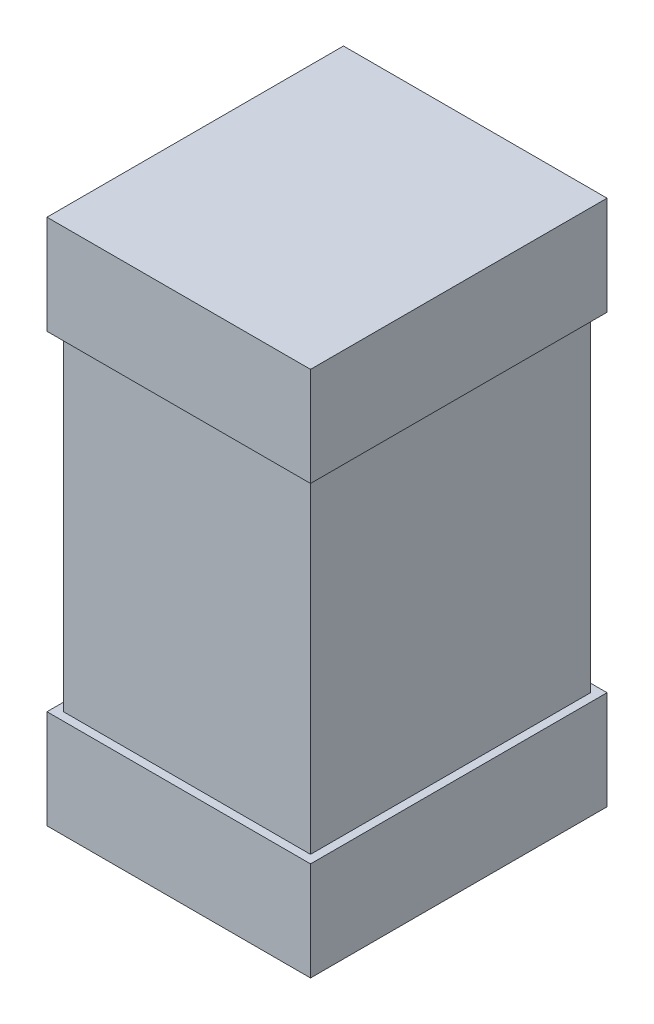
ISO-10303-21;
HEADER;
FILE_DESCRIPTION(('STEP AP214'),'2;1');
FILE_NAME('part.step','',(''),(''),'','','');
FILE_SCHEMA(('AUTOMOTIVE_DESIGN { 1 0 10303 214 1 1 1 1 }'));
ENDSEC;
DATA;
#1=APPLICATION_CONTEXT('core data for automotive mechanical design processes');
#2=APPLICATION_PROTOCOL_DEFINITION('international standard','automotive_design',2000,#1);
#3=PRODUCT_CONTEXT('',#1,'mechanical');
#4=PRODUCT('Part','Part','',(#3));
#5=PRODUCT_RELATED_PRODUCT_CATEGORY('part','',(#4));
#6=PRODUCT_DEFINITION_FORMATION('','',#4);
#7=PRODUCT_DEFINITION_CONTEXT('part definition',#1,'design');
#8=PRODUCT_DEFINITION('design','',#6,#7);
#9=PRODUCT_DEFINITION_SHAPE('','',#8);
#10=(LENGTH_UNIT() NAMED_UNIT(*) SI_UNIT(.MILLI.,.METRE.));
#11=(NAMED_UNIT(*) PLANE_ANGLE_UNIT() SI_UNIT($,.RADIAN.));
#12=(NAMED_UNIT(*) SI_UNIT($,.STERADIAN.) SOLID_ANGLE_UNIT());
#13=UNCERTAINTY_MEASURE_WITH_UNIT(LENGTH_MEASURE(1.E-05),#10,'distance_accuracy_value','');
#14=(GEOMETRIC_REPRESENTATION_CONTEXT(3) GLOBAL_UNCERTAINTY_ASSIGNED_CONTEXT((#13)) GLOBAL_UNIT_ASSIGNED_CONTEXT((#10,
#11,#12)) REPRESENTATION_CONTEXT('',''));
#15=CARTESIAN_POINT('',(0.,0.,0.));
#16=DIRECTION('',(0.,0.,1.));
#17=DIRECTION('',(1.,0.,0.));
#18=AXIS2_PLACEMENT_3D('',#15,#16,#17);
#19=CARTESIAN_POINT('',(-0.375,-0.8,-0.425));
#20=DIRECTION('',(0.,-1.,0.));
#21=DIRECTION('',(0.,0.,-1.));
#22=AXIS2_PLACEMENT_3D('',#19,#20,#21);
#23=PLANE('',#22);
#24=DIRECTION('',(0.,0.,-1.));
#25=VECTOR('',#24,1.);
#26=CARTESIAN_POINT('',(0.4,-0.8,-0.45));
#27=LINE('',#26,#25);
#28=CARTESIAN_POINT('',(0.4,-0.8,0.45));
#29=VERTEX_POINT('',#28);
#30=CARTESIAN_POINT('',(0.4,-0.8,-0.45));
#31=VERTEX_POINT('',#30);
#32=EDGE_CURVE('E108',#29,#31,#27,.T.);
#33=ORIENTED_EDGE('',*,*,#32,.F.);
#34=DIRECTION('',(1.,0.,0.));
#35=VECTOR('',#34,1.);
#36=CARTESIAN_POINT('',(0.4,-0.8,0.45));
#37=LINE('',#36,#35);
#38=CARTESIAN_POINT('',(-0.4,-0.8,0.45));
#39=VERTEX_POINT('',#38);
#40=EDGE_CURVE('E103',#39,#29,#37,.T.);
#41=ORIENTED_EDGE('',*,*,#40,.F.);
#42=DIRECTION('',(0.,0.,1.));
#43=VECTOR('',#42,1.);
#44=CARTESIAN_POINT('',(-0.4,-0.8,0.45));
#45=LINE('',#44,#43);
#46=CARTESIAN_POINT('',(-0.4,-0.8,-0.45));
#47=VERTEX_POINT('',#46);
#48=EDGE_CURVE('E118',#47,#39,#45,.T.);
#49=ORIENTED_EDGE('',*,*,#48,.F.);
#50=DIRECTION('',(-1.,0.,0.));
#51=VECTOR('',#50,1.);
#52=CARTESIAN_POINT('',(-0.4,-0.8,-0.45));
#53=LINE('',#52,#51);
#54=EDGE_CURVE('E20',#31,#47,#53,.T.);
#55=ORIENTED_EDGE('',*,*,#54,.F.);
#56=EDGE_LOOP('',(#33,#41,#49,#55));
#57=FACE_BOUND('',#56,.T.);
#58=ADVANCED_FACE('F17',(#57),#23,.T.);
#59=CARTESIAN_POINT('',(-0.375,0.8,-0.425));
#60=DIRECTION('',(0.,-1.,0.));
#61=DIRECTION('',(0.,0.,-1.));
#62=AXIS2_PLACEMENT_3D('',#59,#60,#61);
#63=PLANE('',#62);
#64=DIRECTION('',(0.,0.,1.));
#65=VECTOR('',#64,1.);
#66=CARTESIAN_POINT('',(-0.4,0.8,-0.45));
#67=LINE('',#66,#65);
#68=CARTESIAN_POINT('',(-0.4,0.8,0.45));
#69=VERTEX_POINT('',#68);
#70=CARTESIAN_POINT('',(-0.4,0.8,-0.45));
#71=VERTEX_POINT('',#70);
#72=EDGE_CURVE('E134',#69,#71,#67,.F.);
#73=ORIENTED_EDGE('',*,*,#72,.F.);
#74=DIRECTION('',(1.,0.,0.));
#75=VECTOR('',#74,1.);
#76=CARTESIAN_POINT('',(-0.4,0.8,0.45));
#77=LINE('',#76,#75);
#78=CARTESIAN_POINT('',(0.4,0.8,0.45));
#79=VERTEX_POINT('',#78);
#80=EDGE_CURVE('E136',#79,#69,#77,.F.);
#81=ORIENTED_EDGE('',*,*,#80,.F.);
#82=DIRECTION('',(0.,0.,-1.));
#83=VECTOR('',#82,1.);
#84=CARTESIAN_POINT('',(0.4,0.8,0.45));
#85=LINE('',#84,#83);
#86=CARTESIAN_POINT('',(0.4,0.8,-0.45));
#87=VERTEX_POINT('',#86);
#88=EDGE_CURVE('E140',#87,#79,#85,.F.);
#89=ORIENTED_EDGE('',*,*,#88,.F.);
#90=DIRECTION('',(-1.,0.,0.));
#91=VECTOR('',#90,1.);
#92=CARTESIAN_POINT('',(0.4,0.8,-0.45));
#93=LINE('',#92,#91);
#94=EDGE_CURVE('E144',#71,#87,#93,.F.);
#95=ORIENTED_EDGE('',*,*,#94,.F.);
#96=EDGE_LOOP('',(#73,#81,#89,#95));
#97=FACE_BOUND('',#96,.T.);
#98=ADVANCED_FACE('F236',(#97),#63,.F.);
#99=CARTESIAN_POINT('',(-0.4,-0.5,-0.45));
#100=DIRECTION('',(0.,0.,-1.));
#101=DIRECTION('',(-1.,0.,0.));
#102=AXIS2_PLACEMENT_3D('',#99,#100,#101);
#103=PLANE('',#102);
#104=DIRECTION('',(1.,0.,0.));
#105=VECTOR('',#104,1.);
#106=CARTESIAN_POINT('',(-0.4,-0.5,-0.45));
#107=LINE('',#106,#105);
#108=CARTESIAN_POINT('',(-0.4,-0.5,-0.45));
#109=VERTEX_POINT('',#108);
#110=CARTESIAN_POINT('',(0.4,-0.5,-0.45));
#111=VERTEX_POINT('',#110);
#112=EDGE_CURVE('E124',#109,#111,#107,.T.);
#113=ORIENTED_EDGE('',*,*,#112,.T.);
#114=DIRECTION('',(0.,1.,0.));
#115=VECTOR('',#114,1.);
#116=CARTESIAN_POINT('',(0.4,-0.5,-0.45));
#117=LINE('',#116,#115);
#118=EDGE_CURVE('E113',#31,#111,#117,.T.);
#119=ORIENTED_EDGE('',*,*,#118,.F.);
#120=ORIENTED_EDGE('',*,*,#54,.T.);
#121=DIRECTION('',(0.,1.,0.));
#122=VECTOR('',#121,1.);
#123=CARTESIAN_POINT('',(-0.4,-0.5,-0.45));
#124=LINE('',#123,#122);
#125=EDGE_CURVE('E132',#109,#47,#124,.F.);
#126=ORIENTED_EDGE('',*,*,#125,.F.);
#127=EDGE_LOOP('',(#113,#119,#120,#126));
#128=FACE_BOUND('',#127,.T.);
#129=ADVANCED_FACE('F123',(#128),#103,.T.);
#130=CARTESIAN_POINT('',(0.4,-0.5,-0.45));
#131=DIRECTION('',(1.,0.,0.));
#132=DIRECTION('',(0.,0.,-1.));
#133=AXIS2_PLACEMENT_3D('',#130,#131,#132);
#134=PLANE('',#133);
#135=DIRECTION('',(0.,0.,-1.));
#136=VECTOR('',#135,1.);
#137=CARTESIAN_POINT('',(0.4,-0.5,-0.45));
#138=LINE('',#137,#136);
#139=CARTESIAN_POINT('',(0.4,-0.5,0.45));
#140=VERTEX_POINT('',#139);
#141=EDGE_CURVE('E154',#111,#140,#138,.F.);
#142=ORIENTED_EDGE('',*,*,#141,.T.);
#143=DIRECTION('',(0.,1.,0.));
#144=VECTOR('',#143,1.);
#145=CARTESIAN_POINT('',(0.4,-0.5,0.45));
#146=LINE('',#145,#144);
#147=EDGE_CURVE('E115',#29,#140,#146,.T.);
#148=ORIENTED_EDGE('',*,*,#147,.F.);
#149=ORIENTED_EDGE('',*,*,#32,.T.);
#150=ORIENTED_EDGE('',*,*,#118,.T.);
#151=EDGE_LOOP('',(#142,#148,#149,#150));
#152=FACE_BOUND('',#151,.T.);
#153=ADVANCED_FACE('F111',(#152),#134,.T.);
#154=CARTESIAN_POINT('',(0.4,-0.5,0.45));
#155=DIRECTION('',(0.,0.,1.));
#156=DIRECTION('',(1.,0.,0.));
#157=AXIS2_PLACEMENT_3D('',#154,#155,#156);
#158=PLANE('',#157);
#159=DIRECTION('',(1.,0.,0.));
#160=VECTOR('',#159,1.);
#161=CARTESIAN_POINT('',(-0.4,-0.5,0.45));
#162=LINE('',#161,#160);
#163=CARTESIAN_POINT('',(-0.4,-0.5,0.45));
#164=VERTEX_POINT('',#163);
#165=EDGE_CURVE('E156',#140,#164,#162,.F.);
#166=ORIENTED_EDGE('',*,*,#165,.T.);
#167=DIRECTION('',(0.,1.,0.));
#168=VECTOR('',#167,1.);
#169=CARTESIAN_POINT('',(-0.4,-0.5,0.45));
#170=LINE('',#169,#168);
#171=EDGE_CURVE('E130',#39,#164,#170,.T.);
#172=ORIENTED_EDGE('',*,*,#171,.F.);
#173=ORIENTED_EDGE('',*,*,#40,.T.);
#174=ORIENTED_EDGE('',*,*,#147,.T.);
#175=EDGE_LOOP('',(#166,#172,#173,#174));
#176=FACE_BOUND('',#175,.T.);
#177=ADVANCED_FACE('F270',(#176),#158,.T.);
#178=CARTESIAN_POINT('',(-0.4,-0.5,0.45));
#179=DIRECTION('',(-1.,0.,0.));
#180=DIRECTION('',(0.,0.,1.));
#181=AXIS2_PLACEMENT_3D('',#178,#179,#180);
#182=PLANE('',#181);
#183=DIRECTION('',(0.,0.,-1.));
#184=VECTOR('',#183,1.);
#185=CARTESIAN_POINT('',(-0.4,-0.5,-0.45));
#186=LINE('',#185,#184);
#187=EDGE_CURVE('E159',#164,#109,#186,.T.);
#188=ORIENTED_EDGE('',*,*,#187,.T.);
#189=ORIENTED_EDGE('',*,*,#125,.T.);
#190=ORIENTED_EDGE('',*,*,#48,.T.);
#191=ORIENTED_EDGE('',*,*,#171,.T.);
#192=EDGE_LOOP('',(#188,#189,#190,#191));
#193=FACE_BOUND('',#192,.T.);
#194=ADVANCED_FACE('F267',(#193),#182,.T.);
#195=CARTESIAN_POINT('',(-0.4,0.5,-0.45));
#196=DIRECTION('',(-1.,0.,0.));
#197=DIRECTION('',(0.,0.,1.));
#198=AXIS2_PLACEMENT_3D('',#195,#196,#197);
#199=PLANE('',#198);
#200=DIRECTION('',(0.,0.,1.));
#201=VECTOR('',#200,1.);
#202=CARTESIAN_POINT('',(-0.4,0.5,-0.45));
#203=LINE('',#202,#201);
#204=CARTESIAN_POINT('',(-0.4,0.5,-0.45));
#205=VERTEX_POINT('',#204);
#206=CARTESIAN_POINT('',(-0.4,0.5,0.45));
#207=VERTEX_POINT('',#206);
#208=EDGE_CURVE('E172',#205,#207,#203,.T.);
#209=ORIENTED_EDGE('',*,*,#208,.T.);
#210=DIRECTION('',(0.,1.,0.));
#211=VECTOR('',#210,1.);
#212=CARTESIAN_POINT('',(-0.4,0.5,0.45));
#213=LINE('',#212,#211);
#214=EDGE_CURVE('E138',#69,#207,#213,.F.);
#215=ORIENTED_EDGE('',*,*,#214,.F.);
#216=ORIENTED_EDGE('',*,*,#72,.T.);
#217=DIRECTION('',(0.,1.,0.));
#218=VECTOR('',#217,1.);
#219=CARTESIAN_POINT('',(-0.4,0.5,-0.45));
#220=LINE('',#219,#218);
#221=EDGE_CURVE('E148',#205,#71,#220,.T.);
#222=ORIENTED_EDGE('',*,*,#221,.F.);
#223=EDGE_LOOP('',(#209,#215,#216,#222));
#224=FACE_BOUND('',#223,.T.);
#225=ADVANCED_FACE('F228',(#224),#199,.T.);
#226=CARTESIAN_POINT('',(-0.4,0.5,0.45));
#227=DIRECTION('',(0.,0.,1.));
#228=DIRECTION('',(1.,0.,0.));
#229=AXIS2_PLACEMENT_3D('',#226,#227,#228);
#230=PLANE('',#229);
#231=DIRECTION('',(1.,0.,0.));
#232=VECTOR('',#231,1.);
#233=CARTESIAN_POINT('',(-0.4,0.5,0.45));
#234=LINE('',#233,#232);
#235=CARTESIAN_POINT('',(0.4,0.5,0.45));
#236=VERTEX_POINT('',#235);
#237=EDGE_CURVE('E175',#207,#236,#234,.T.);
#238=ORIENTED_EDGE('',*,*,#237,.T.);
#239=DIRECTION('',(0.,1.,0.));
#240=VECTOR('',#239,1.);
#241=CARTESIAN_POINT('',(0.4,0.5,0.45));
#242=LINE('',#241,#240);
#243=EDGE_CURVE('E142',#79,#236,#242,.F.);
#244=ORIENTED_EDGE('',*,*,#243,.F.);
#245=ORIENTED_EDGE('',*,*,#80,.T.);
#246=ORIENTED_EDGE('',*,*,#214,.T.);
#247=EDGE_LOOP('',(#238,#244,#245,#246));
#248=FACE_BOUND('',#247,.T.);
#249=ADVANCED_FACE('F223',(#248),#230,.T.);
#250=CARTESIAN_POINT('',(0.4,0.5,0.45));
#251=DIRECTION('',(1.,0.,0.));
#252=DIRECTION('',(0.,0.,-1.));
#253=AXIS2_PLACEMENT_3D('',#250,#251,#252);
#254=PLANE('',#253);
#255=DIRECTION('',(0.,0.,1.));
#256=VECTOR('',#255,1.);
#257=CARTESIAN_POINT('',(0.4,0.5,-0.45));
#258=LINE('',#257,#256);
#259=CARTESIAN_POINT('',(0.4,0.5,-0.45));
#260=VERTEX_POINT('',#259);
#261=EDGE_CURVE('E178',#236,#260,#258,.F.);
#262=ORIENTED_EDGE('',*,*,#261,.T.);
#263=DIRECTION('',(0.,1.,0.));
#264=VECTOR('',#263,1.);
#265=CARTESIAN_POINT('',(0.4,0.5,-0.45));
#266=LINE('',#265,#264);
#267=EDGE_CURVE('E146',#87,#260,#266,.F.);
#268=ORIENTED_EDGE('',*,*,#267,.F.);
#269=ORIENTED_EDGE('',*,*,#88,.T.);
#270=ORIENTED_EDGE('',*,*,#243,.T.);
#271=EDGE_LOOP('',(#262,#268,#269,#270));
#272=FACE_BOUND('',#271,.T.);
#273=ADVANCED_FACE('F234',(#272),#254,.T.);
#274=CARTESIAN_POINT('',(0.4,0.5,-0.45));
#275=DIRECTION('',(0.,0.,-1.));
#276=DIRECTION('',(-1.,0.,0.));
#277=AXIS2_PLACEMENT_3D('',#274,#275,#276);
#278=PLANE('',#277);
#279=DIRECTION('',(1.,0.,0.));
#280=VECTOR('',#279,1.);
#281=CARTESIAN_POINT('',(-0.4,0.5,-0.45));
#282=LINE('',#281,#280);
#283=EDGE_CURVE('E181',#260,#205,#282,.F.);
#284=ORIENTED_EDGE('',*,*,#283,.T.);
#285=ORIENTED_EDGE('',*,*,#221,.T.);
#286=ORIENTED_EDGE('',*,*,#94,.T.);
#287=ORIENTED_EDGE('',*,*,#267,.T.);
#288=EDGE_LOOP('',(#284,#285,#286,#287));
#289=FACE_BOUND('',#288,.T.);
#290=ADVANCED_FACE('F232',(#289),#278,.T.);
#291=CARTESIAN_POINT('',(-0.375,-0.8,0.425));
#292=DIRECTION('',(1.,0.,0.));
#293=DIRECTION('',(0.,0.,-1.));
#294=AXIS2_PLACEMENT_3D('',#291,#292,#293);
#295=PLANE('',#294);
#296=DIRECTION('',(0.,1.,0.));
#297=VECTOR('',#296,1.);
#298=CARTESIAN_POINT('',(-0.375,-0.8,-0.425));
#299=LINE('',#298,#297);
#300=CARTESIAN_POINT('',(-0.375,0.5,-0.425));
#301=VERTEX_POINT('',#300);
#302=CARTESIAN_POINT('',(-0.375,-0.5,-0.425));
#303=VERTEX_POINT('',#302);
#304=EDGE_CURVE('E151',#301,#303,#299,.F.);
#305=ORIENTED_EDGE('',*,*,#304,.T.);
#306=DIRECTION('',(0.,0.,-1.));
#307=VECTOR('',#306,1.);
#308=CARTESIAN_POINT('',(-0.375,-0.5,-0.45));
#309=LINE('',#308,#307);
#310=CARTESIAN_POINT('',(-0.375,-0.5,0.425));
#311=VERTEX_POINT('',#310);
#312=EDGE_CURVE('E165',#303,#311,#309,.F.);
#313=ORIENTED_EDGE('',*,*,#312,.T.);
#314=DIRECTION('',(0.,1.,0.));
#315=VECTOR('',#314,1.);
#316=CARTESIAN_POINT('',(-0.375,-0.8,0.425));
#317=LINE('',#316,#315);
#318=CARTESIAN_POINT('',(-0.375,0.5,0.425));
#319=VERTEX_POINT('',#318);
#320=EDGE_CURVE('E170',#311,#319,#317,.T.);
#321=ORIENTED_EDGE('',*,*,#320,.T.);
#322=DIRECTION('',(0.,0.,1.));
#323=VECTOR('',#322,1.);
#324=CARTESIAN_POINT('',(-0.375,0.5,-0.45));
#325=LINE('',#324,#323);
#326=EDGE_CURVE('E185',#319,#301,#325,.F.);
#327=ORIENTED_EDGE('',*,*,#326,.T.);
#328=EDGE_LOOP('',(#305,#313,#321,#327));
#329=FACE_BOUND('',#328,.T.);
#330=ADVANCED_FACE('F255',(#329),#295,.F.);
#331=CARTESIAN_POINT('',(-0.375,-0.8,-0.425));
#332=DIRECTION('',(0.,0.,1.));
#333=DIRECTION('',(1.,0.,0.));
#334=AXIS2_PLACEMENT_3D('',#331,#332,#333);
#335=PLANE('',#334);
#336=DIRECTION('',(0.,1.,0.));
#337=VECTOR('',#336,1.);
#338=CARTESIAN_POINT('',(0.375,-0.8,-0.425));
#339=LINE('',#338,#337);
#340=CARTESIAN_POINT('',(0.375,0.5,-0.425));
#341=VERTEX_POINT('',#340);
#342=CARTESIAN_POINT('',(0.375,-0.5,-0.425));
#343=VERTEX_POINT('',#342);
#344=EDGE_CURVE('E191',#341,#343,#339,.F.);
#345=ORIENTED_EDGE('',*,*,#344,.T.);
#346=DIRECTION('',(1.,0.,0.));
#347=VECTOR('',#346,1.);
#348=CARTESIAN_POINT('',(-0.4,-0.5,-0.425));
#349=LINE('',#348,#347);
#350=EDGE_CURVE('E162',#343,#303,#349,.F.);
#351=ORIENTED_EDGE('',*,*,#350,.T.);
#352=ORIENTED_EDGE('',*,*,#304,.F.);
#353=DIRECTION('',(1.,0.,0.));
#354=VECTOR('',#353,1.);
#355=CARTESIAN_POINT('',(-0.4,0.5,-0.425));
#356=LINE('',#355,#354);
#357=EDGE_CURVE('E188',#301,#341,#356,.T.);
#358=ORIENTED_EDGE('',*,*,#357,.T.);
#359=EDGE_LOOP('',(#345,#351,#352,#358));
#360=FACE_BOUND('',#359,.T.);
#361=ADVANCED_FACE('F210',(#360),#335,.F.);
#362=CARTESIAN_POINT('',(-0.4,-0.5,-0.45));
#363=DIRECTION('',(0.,-1.,0.));
#364=DIRECTION('',(0.,0.,-1.));
#365=AXIS2_PLACEMENT_3D('',#362,#363,#364);
#366=PLANE('',#365);
#367=ORIENTED_EDGE('',*,*,#312,.F.);
#368=ORIENTED_EDGE('',*,*,#350,.F.);
#369=DIRECTION('',(0.,0.,1.));
#370=VECTOR('',#369,1.);
#371=CARTESIAN_POINT('',(0.375,-0.5,-0.425));
#372=LINE('',#371,#370);
#373=CARTESIAN_POINT('',(0.375,-0.5,0.425));
#374=VERTEX_POINT('',#373);
#375=EDGE_CURVE('E194',#343,#374,#372,.T.);
#376=ORIENTED_EDGE('',*,*,#375,.T.);
#377=DIRECTION('',(-1.,0.,0.));
#378=VECTOR('',#377,1.);
#379=CARTESIAN_POINT('',(0.375,-0.5,0.425));
#380=LINE('',#379,#378);
#381=EDGE_CURVE('E167',#374,#311,#380,.T.);
#382=ORIENTED_EDGE('',*,*,#381,.T.);
#383=EDGE_LOOP('',(#367,#368,#376,#382));
#384=FACE_BOUND('',#383,.T.);
#385=ORIENTED_EDGE('',*,*,#165,.F.);
#386=ORIENTED_EDGE('',*,*,#141,.F.);
#387=ORIENTED_EDGE('',*,*,#112,.F.);
#388=ORIENTED_EDGE('',*,*,#187,.F.);
#389=EDGE_LOOP('',(#385,#386,#387,#388));
#390=FACE_BOUND('',#389,.T.);
#391=ADVANCED_FACE('F207',(#384,#390),#366,.F.);
#392=CARTESIAN_POINT('',(0.375,-0.8,0.425));
#393=DIRECTION('',(0.,0.,-1.));
#394=DIRECTION('',(-1.,0.,0.));
#395=AXIS2_PLACEMENT_3D('',#392,#393,#394);
#396=PLANE('',#395);
#397=ORIENTED_EDGE('',*,*,#320,.F.);
#398=ORIENTED_EDGE('',*,*,#381,.F.);
#399=DIRECTION('',(0.,1.,0.));
#400=VECTOR('',#399,1.);
#401=CARTESIAN_POINT('',(0.375,-0.8,0.425));
#402=LINE('',#401,#400);
#403=CARTESIAN_POINT('',(0.375,0.5,0.425));
#404=VERTEX_POINT('',#403);
#405=EDGE_CURVE('E26',#374,#404,#402,.T.);
#406=ORIENTED_EDGE('',*,*,#405,.T.);
#407=DIRECTION('',(1.,0.,0.));
#408=VECTOR('',#407,1.);
#409=CARTESIAN_POINT('',(-0.4,0.5,0.425));
#410=LINE('',#409,#408);
#411=EDGE_CURVE('E34',#404,#319,#410,.F.);
#412=ORIENTED_EDGE('',*,*,#411,.T.);
#413=EDGE_LOOP('',(#397,#398,#406,#412));
#414=FACE_BOUND('',#413,.T.);
#415=ADVANCED_FACE('F201',(#414),#396,.F.);
#416=CARTESIAN_POINT('',(-0.4,0.5,-0.45));
#417=DIRECTION('',(0.,1.,0.));
#418=DIRECTION('',(0.,0.,1.));
#419=AXIS2_PLACEMENT_3D('',#416,#417,#418);
#420=PLANE('',#419);
#421=ORIENTED_EDGE('',*,*,#326,.F.);
#422=ORIENTED_EDGE('',*,*,#411,.F.);
#423=DIRECTION('',(0.,0.,1.));
#424=VECTOR('',#423,1.);
#425=CARTESIAN_POINT('',(0.375,0.5,-0.425));
#426=LINE('',#425,#424);
#427=EDGE_CURVE('E11',#404,#341,#426,.F.);
#428=ORIENTED_EDGE('',*,*,#427,.T.);
#429=ORIENTED_EDGE('',*,*,#357,.F.);
#430=EDGE_LOOP('',(#421,#422,#428,#429));
#431=FACE_BOUND('',#430,.T.);
#432=ORIENTED_EDGE('',*,*,#261,.F.);
#433=ORIENTED_EDGE('',*,*,#237,.F.);
#434=ORIENTED_EDGE('',*,*,#208,.F.);
#435=ORIENTED_EDGE('',*,*,#283,.F.);
#436=EDGE_LOOP('',(#432,#433,#434,#435));
#437=FACE_BOUND('',#436,.T.);
#438=ADVANCED_FACE('F212',(#431,#437),#420,.F.);
#439=CARTESIAN_POINT('',(0.375,-0.8,-0.425));
#440=DIRECTION('',(-1.,0.,0.));
#441=DIRECTION('',(0.,0.,1.));
#442=AXIS2_PLACEMENT_3D('',#439,#440,#441);
#443=PLANE('',#442);
#444=ORIENTED_EDGE('',*,*,#405,.F.);
#445=ORIENTED_EDGE('',*,*,#375,.F.);
#446=ORIENTED_EDGE('',*,*,#344,.F.);
#447=ORIENTED_EDGE('',*,*,#427,.F.);
#448=EDGE_LOOP('',(#444,#445,#446,#447));
#449=FACE_BOUND('',#448,.T.);
#450=ADVANCED_FACE('F204',(#449),#443,.F.);
#451=CLOSED_SHELL('',(#58,#98,#129,#153,#177,#194,#225,#249,#273,#290,#330,#361,#391,#415,#438,#450));
#452=MANIFOLD_SOLID_BREP('B1',#451);
#453=ADVANCED_BREP_SHAPE_REPRESENTATION('',(#18,#452),#14);
#454=SHAPE_DEFINITION_REPRESENTATION(#9,#453);
ENDSEC;
END-ISO-10303-21;
